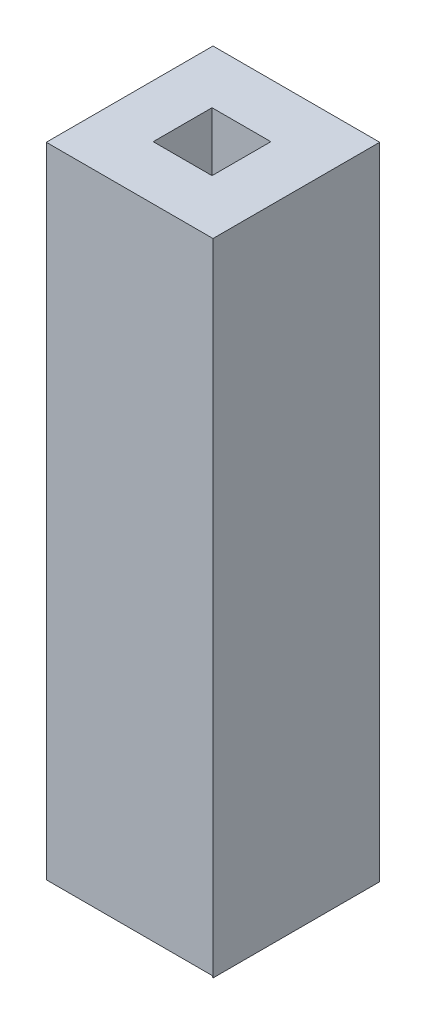
ISO-10303-21;
HEADER;
FILE_DESCRIPTION(('STEP AP214'),'2;1');
FILE_NAME('part.step','',(''),(''),'','','');
FILE_SCHEMA(('AUTOMOTIVE_DESIGN { 1 0 10303 214 1 1 1 1 }'));
ENDSEC;
DATA;
#1=APPLICATION_CONTEXT('core data for automotive mechanical design processes');
#2=APPLICATION_PROTOCOL_DEFINITION('international standard','automotive_design',2000,#1);
#3=PRODUCT_CONTEXT('',#1,'mechanical');
#4=PRODUCT('Part','Part','',(#3));
#5=PRODUCT_RELATED_PRODUCT_CATEGORY('part','',(#4));
#6=PRODUCT_DEFINITION_FORMATION('','',#4);
#7=PRODUCT_DEFINITION_CONTEXT('part definition',#1,'design');
#8=PRODUCT_DEFINITION('design','',#6,#7);
#9=PRODUCT_DEFINITION_SHAPE('','',#8);
#10=(LENGTH_UNIT() NAMED_UNIT(*) SI_UNIT(.MILLI.,.METRE.));
#11=(NAMED_UNIT(*) PLANE_ANGLE_UNIT() SI_UNIT($,.RADIAN.));
#12=(NAMED_UNIT(*) SI_UNIT($,.STERADIAN.) SOLID_ANGLE_UNIT());
#13=UNCERTAINTY_MEASURE_WITH_UNIT(LENGTH_MEASURE(1.E-05),#10,'distance_accuracy_value','');
#14=(GEOMETRIC_REPRESENTATION_CONTEXT(3) GLOBAL_UNCERTAINTY_ASSIGNED_CONTEXT((#13)) GLOBAL_UNIT_ASSIGNED_CONTEXT((#10,
#11,#12)) REPRESENTATION_CONTEXT('',''));
#15=CARTESIAN_POINT('',(0.,0.,0.));
#16=DIRECTION('',(0.,0.,1.));
#17=DIRECTION('',(1.,0.,0.));
#18=AXIS2_PLACEMENT_3D('',#15,#16,#17);
#19=CARTESIAN_POINT('',(0.,11.,0.));
#20=DIRECTION('',(1.,0.,0.));
#21=DIRECTION('',(0.,0.,-1.));
#22=AXIS2_PLACEMENT_3D('',#19,#20,#21);
#23=PLANE('',#22);
#24=DIRECTION('',(0.,0.,1.));
#25=VECTOR('',#24,1.);
#26=CARTESIAN_POINT('',(0.,0.17320508075691,-0.916665000000001));
#27=LINE('',#26,#25);
#28=CARTESIAN_POINT('',(0.,0.17320508075691,-2.816665));
#29=VERTEX_POINT('',#28);
#30=CARTESIAN_POINT('',(0.,0.17320508075691,-0.0166650000000009));
#31=VERTEX_POINT('',#30);
#32=EDGE_CURVE('E174',#29,#31,#27,.T.);
#33=ORIENTED_EDGE('',*,*,#32,.T.);
#34=DIRECTION('',(0.,-0.866025403784441,0.499999999999996));
#35=VECTOR('',#34,1.);
#36=CARTESIAN_POINT('',(0.,1.73205080756892,-0.916665000000001));
#37=LINE('',#36,#35);
#38=CARTESIAN_POINT('',(0.,0.144340454048774,0.));
#39=VERTEX_POINT('',#38);
#40=EDGE_CURVE('E176',#31,#39,#37,.T.);
#41=ORIENTED_EDGE('',*,*,#40,.T.);
#42=DIRECTION('',(0.,-1.,0.));
#43=VECTOR('',#42,1.);
#44=CARTESIAN_POINT('',(0.,11.,0.));
#45=LINE('',#44,#43);
#46=CARTESIAN_POINT('',(0.,11.,0.));
#47=VERTEX_POINT('',#46);
#48=EDGE_CURVE('E166',#47,#39,#45,.T.);
#49=ORIENTED_EDGE('',*,*,#48,.F.);
#50=DIRECTION('',(0.,0.,1.));
#51=VECTOR('',#50,1.);
#52=CARTESIAN_POINT('',(0.,11.,0.));
#53=LINE('',#52,#51);
#54=CARTESIAN_POINT('',(0.,11.,-2.83333));
#55=VERTEX_POINT('',#54);
#56=EDGE_CURVE('E146',#55,#47,#53,.T.);
#57=ORIENTED_EDGE('',*,*,#56,.F.);
#58=DIRECTION('',(0.,-1.,0.));
#59=VECTOR('',#58,1.);
#60=CARTESIAN_POINT('',(0.,11.,-2.83333));
#61=LINE('',#60,#59);
#62=CARTESIAN_POINT('',(0.,0.14434045404878,-2.83333));
#63=VERTEX_POINT('',#62);
#64=EDGE_CURVE('E159',#55,#63,#61,.T.);
#65=ORIENTED_EDGE('',*,*,#64,.T.);
#66=DIRECTION('',(0.,0.866025403784441,0.499999999999996));
#67=VECTOR('',#66,1.);
#68=CARTESIAN_POINT('',(0.,1.73205080756892,-1.916665));
#69=LINE('',#68,#67);
#70=EDGE_CURVE('E172',#63,#29,#69,.T.);
#71=ORIENTED_EDGE('',*,*,#70,.T.);
#72=EDGE_LOOP('',(#33,#41,#49,#57,#65,#71));
#73=FACE_BOUND('',#72,.T.);
#74=ADVANCED_FACE('F33',(#73),#23,.F.);
#75=CARTESIAN_POINT('',(0.,11.,0.));
#76=DIRECTION('',(0.,0.,-1.));
#77=DIRECTION('',(-1.,0.,0.));
#78=AXIS2_PLACEMENT_3D('',#75,#76,#77);
#79=PLANE('',#78);
#80=ORIENTED_EDGE('',*,*,#48,.T.);
#81=DIRECTION('',(1.,0.,0.));
#82=VECTOR('',#81,1.);
#83=CARTESIAN_POINT('',(1.9,0.144340454048773,0.));
#84=LINE('',#83,#82);
#85=CARTESIAN_POINT('',(2.816665,0.144340454048772,0.));
#86=VERTEX_POINT('',#85);
#87=EDGE_CURVE('E181',#39,#86,#84,.T.);
#88=ORIENTED_EDGE('',*,*,#87,.T.);
#89=DIRECTION('',(0.499999999999996,-0.866025403784441,0.));
#90=VECTOR('',#89,1.);
#91=CARTESIAN_POINT('',(1.9,1.73205080756892,0.));
#92=LINE('',#91,#90);
#93=CARTESIAN_POINT('',(2.83333,0.115475827340637,0.));
#94=VERTEX_POINT('',#93);
#95=EDGE_CURVE('E179',#86,#94,#92,.T.);
#96=ORIENTED_EDGE('',*,*,#95,.T.);
#97=DIRECTION('',(0.,-1.,0.));
#98=VECTOR('',#97,1.);
#99=CARTESIAN_POINT('',(2.83333,11.,0.));
#100=LINE('',#99,#98);
#101=CARTESIAN_POINT('',(2.83333,11.,0.));
#102=VERTEX_POINT('',#101);
#103=EDGE_CURVE('E164',#102,#94,#100,.T.);
#104=ORIENTED_EDGE('',*,*,#103,.F.);
#105=DIRECTION('',(1.,0.,0.));
#106=VECTOR('',#105,1.);
#107=CARTESIAN_POINT('',(0.,11.,0.));
#108=LINE('',#107,#106);
#109=EDGE_CURVE('E153',#47,#102,#108,.T.);
#110=ORIENTED_EDGE('',*,*,#109,.F.);
#111=EDGE_LOOP('',(#80,#88,#96,#104,#110));
#112=FACE_BOUND('',#111,.T.);
#113=ADVANCED_FACE('F217',(#112),#79,.F.);
#114=CARTESIAN_POINT('',(2.83333,11.,0.));
#115=DIRECTION('',(-1.,0.,0.));
#116=DIRECTION('',(0.,0.,1.));
#117=AXIS2_PLACEMENT_3D('',#114,#115,#116);
#118=PLANE('',#117);
#119=ORIENTED_EDGE('',*,*,#103,.T.);
#120=DIRECTION('',(0.,0.,-1.));
#121=VECTOR('',#120,1.);
#122=CARTESIAN_POINT('',(2.83333,0.115475827340637,-0.916665000000003));
#123=LINE('',#122,#121);
#124=CARTESIAN_POINT('',(2.83333,0.115475827340643,-2.83333));
#125=VERTEX_POINT('',#124);
#126=EDGE_CURVE('E11',#94,#125,#123,.T.);
#127=ORIENTED_EDGE('',*,*,#126,.T.);
#128=DIRECTION('',(0.,-1.,0.));
#129=VECTOR('',#128,1.);
#130=CARTESIAN_POINT('',(2.83333,11.,-2.83333));
#131=LINE('',#130,#129);
#132=CARTESIAN_POINT('',(2.83333,11.,-2.83333));
#133=VERTEX_POINT('',#132);
#134=EDGE_CURVE('E162',#133,#125,#131,.T.);
#135=ORIENTED_EDGE('',*,*,#134,.F.);
#136=DIRECTION('',(0.,0.,-1.));
#137=VECTOR('',#136,1.);
#138=CARTESIAN_POINT('',(2.83333,11.,0.));
#139=LINE('',#138,#137);
#140=EDGE_CURVE('E155',#102,#133,#139,.T.);
#141=ORIENTED_EDGE('',*,*,#140,.F.);
#142=EDGE_LOOP('',(#119,#127,#135,#141));
#143=FACE_BOUND('',#142,.T.);
#144=ADVANCED_FACE('F226',(#143),#118,.F.);
#145=CARTESIAN_POINT('',(0.,11.,-2.83333));
#146=DIRECTION('',(0.,0.,1.));
#147=DIRECTION('',(1.,0.,0.));
#148=AXIS2_PLACEMENT_3D('',#145,#146,#147);
#149=PLANE('',#148);
#150=DIRECTION('',(-0.499999999999996,0.866025403784441,0.));
#151=VECTOR('',#150,1.);
#152=CARTESIAN_POINT('',(1.9,1.73205080756892,-2.83333));
#153=LINE('',#152,#151);
#154=CARTESIAN_POINT('',(2.816665,0.144340454048773,-2.83333));
#155=VERTEX_POINT('',#154);
#156=EDGE_CURVE('E50',#125,#155,#153,.T.);
#157=ORIENTED_EDGE('',*,*,#156,.T.);
#158=DIRECTION('',(-1.,0.,0.));
#159=VECTOR('',#158,1.);
#160=CARTESIAN_POINT('',(1.9,0.144340454048773,-2.83333));
#161=LINE('',#160,#159);
#162=EDGE_CURVE('E187',#155,#63,#161,.T.);
#163=ORIENTED_EDGE('',*,*,#162,.T.);
#164=ORIENTED_EDGE('',*,*,#64,.F.);
#165=DIRECTION('',(-1.,0.,0.));
#166=VECTOR('',#165,1.);
#167=CARTESIAN_POINT('',(0.,11.,-2.83333));
#168=LINE('',#167,#166);
#169=EDGE_CURVE('E157',#133,#55,#168,.T.);
#170=ORIENTED_EDGE('',*,*,#169,.F.);
#171=ORIENTED_EDGE('',*,*,#134,.T.);
#172=EDGE_LOOP('',(#157,#163,#164,#170,#171));
#173=FACE_BOUND('',#172,.T.);
#174=ADVANCED_FACE('F223',(#173),#149,.F.);
#175=CARTESIAN_POINT('',(0.,11.,0.));
#176=DIRECTION('',(0.,-1.,0.));
#177=DIRECTION('',(0.,0.,-1.));
#178=AXIS2_PLACEMENT_3D('',#175,#176,#177);
#179=PLANE('',#178);
#180=DIRECTION('',(-1.,0.,0.));
#181=VECTOR('',#180,1.);
#182=CARTESIAN_POINT('',(1.9,11.,-0.916665000000001));
#183=LINE('',#182,#181);
#184=CARTESIAN_POINT('',(1.9,11.,-0.916665000000001));
#185=VERTEX_POINT('',#184);
#186=CARTESIAN_POINT('',(0.9,11.,-0.916665000000001));
#187=VERTEX_POINT('',#186);
#188=EDGE_CURVE('E124',#185,#187,#183,.T.);
#189=ORIENTED_EDGE('',*,*,#188,.T.);
#190=DIRECTION('',(0.,0.,-1.));
#191=VECTOR('',#190,1.);
#192=CARTESIAN_POINT('',(0.9,11.,-0.916665000000001));
#193=LINE('',#192,#191);
#194=CARTESIAN_POINT('',(0.9,11.,-1.916665));
#195=VERTEX_POINT('',#194);
#196=EDGE_CURVE('E117',#187,#195,#193,.T.);
#197=ORIENTED_EDGE('',*,*,#196,.T.);
#198=DIRECTION('',(1.,0.,0.));
#199=VECTOR('',#198,1.);
#200=CARTESIAN_POINT('',(1.9,11.,-1.916665));
#201=LINE('',#200,#199);
#202=CARTESIAN_POINT('',(1.9,11.,-1.916665));
#203=VERTEX_POINT('',#202);
#204=EDGE_CURVE('E128',#195,#203,#201,.T.);
#205=ORIENTED_EDGE('',*,*,#204,.T.);
#206=DIRECTION('',(0.,0.,1.));
#207=VECTOR('',#206,1.);
#208=CARTESIAN_POINT('',(1.9,11.,-0.916665000000001));
#209=LINE('',#208,#207);
#210=EDGE_CURVE('E133',#203,#185,#209,.T.);
#211=ORIENTED_EDGE('',*,*,#210,.T.);
#212=EDGE_LOOP('',(#189,#197,#205,#211));
#213=FACE_BOUND('',#212,.T.);
#214=ORIENTED_EDGE('',*,*,#56,.T.);
#215=ORIENTED_EDGE('',*,*,#109,.T.);
#216=ORIENTED_EDGE('',*,*,#140,.T.);
#217=ORIENTED_EDGE('',*,*,#169,.T.);
#218=EDGE_LOOP('',(#214,#215,#216,#217));
#219=FACE_BOUND('',#218,.T.);
#220=ADVANCED_FACE('F135',(#213,#219),#179,.F.);
#221=CARTESIAN_POINT('',(0.9,11.,-0.916665000000001));
#222=DIRECTION('',(-1.,0.,0.));
#223=DIRECTION('',(0.,0.,1.));
#224=AXIS2_PLACEMENT_3D('',#221,#222,#223);
#225=PLANE('',#224);
#226=DIRECTION('',(0.,-1.,0.));
#227=VECTOR('',#226,1.);
#228=CARTESIAN_POINT('',(0.9,11.,-0.916665000000001));
#229=LINE('',#228,#227);
#230=CARTESIAN_POINT('',(0.9,1.73205080756892,-0.916665000000001));
#231=VERTEX_POINT('',#230);
#232=EDGE_CURVE('E144',#187,#231,#229,.T.);
#233=ORIENTED_EDGE('',*,*,#232,.T.);
#234=DIRECTION('',(0.,0.,-1.));
#235=VECTOR('',#234,1.);
#236=CARTESIAN_POINT('',(0.9,1.73205080756892,-1.916665));
#237=LINE('',#236,#235);
#238=CARTESIAN_POINT('',(0.9,1.73205080756892,-1.916665));
#239=VERTEX_POINT('',#238);
#240=EDGE_CURVE('E120',#231,#239,#237,.T.);
#241=ORIENTED_EDGE('',*,*,#240,.T.);
#242=DIRECTION('',(0.,-1.,0.));
#243=VECTOR('',#242,1.);
#244=CARTESIAN_POINT('',(0.9,11.,-1.916665));
#245=LINE('',#244,#243);
#246=EDGE_CURVE('E112',#195,#239,#245,.T.);
#247=ORIENTED_EDGE('',*,*,#246,.F.);
#248=ORIENTED_EDGE('',*,*,#196,.F.);
#249=EDGE_LOOP('',(#233,#241,#247,#248));
#250=FACE_BOUND('',#249,.T.);
#251=ADVANCED_FACE('F115',(#250),#225,.F.);
#252=CARTESIAN_POINT('',(1.9,11.,-0.916665000000001));
#253=DIRECTION('',(0.,0.,1.));
#254=DIRECTION('',(1.,0.,0.));
#255=AXIS2_PLACEMENT_3D('',#252,#253,#254);
#256=PLANE('',#255);
#257=DIRECTION('',(0.,-1.,0.));
#258=VECTOR('',#257,1.);
#259=CARTESIAN_POINT('',(1.9,11.,-0.916665000000001));
#260=LINE('',#259,#258);
#261=CARTESIAN_POINT('',(1.9,1.73205080756892,-0.916665000000001));
#262=VERTEX_POINT('',#261);
#263=EDGE_CURVE('E147',#185,#262,#260,.T.);
#264=ORIENTED_EDGE('',*,*,#263,.T.);
#265=DIRECTION('',(-1.,0.,0.));
#266=VECTOR('',#265,1.);
#267=CARTESIAN_POINT('',(0.9,1.73205080756892,-0.916665000000001));
#268=LINE('',#267,#266);
#269=EDGE_CURVE('E169',#262,#231,#268,.T.);
#270=ORIENTED_EDGE('',*,*,#269,.T.);
#271=ORIENTED_EDGE('',*,*,#232,.F.);
#272=ORIENTED_EDGE('',*,*,#188,.F.);
#273=EDGE_LOOP('',(#264,#270,#271,#272));
#274=FACE_BOUND('',#273,.T.);
#275=ADVANCED_FACE('F208',(#274),#256,.F.);
#276=CARTESIAN_POINT('',(1.9,11.,-0.916665000000001));
#277=DIRECTION('',(1.,0.,0.));
#278=DIRECTION('',(0.,0.,-1.));
#279=AXIS2_PLACEMENT_3D('',#276,#277,#278);
#280=PLANE('',#279);
#281=DIRECTION('',(0.,-1.,0.));
#282=VECTOR('',#281,1.);
#283=CARTESIAN_POINT('',(1.9,11.,-1.916665));
#284=LINE('',#283,#282);
#285=CARTESIAN_POINT('',(1.9,1.73205080756892,-1.916665));
#286=VERTEX_POINT('',#285);
#287=EDGE_CURVE('E123',#203,#286,#284,.T.);
#288=ORIENTED_EDGE('',*,*,#287,.T.);
#289=DIRECTION('',(0.,0.,1.));
#290=VECTOR('',#289,1.);
#291=CARTESIAN_POINT('',(1.9,1.73205080756892,-0.916665000000001));
#292=LINE('',#291,#290);
#293=EDGE_CURVE('E42',#286,#262,#292,.T.);
#294=ORIENTED_EDGE('',*,*,#293,.T.);
#295=ORIENTED_EDGE('',*,*,#263,.F.);
#296=ORIENTED_EDGE('',*,*,#210,.F.);
#297=EDGE_LOOP('',(#288,#294,#295,#296));
#298=FACE_BOUND('',#297,.T.);
#299=ADVANCED_FACE('F205',(#298),#280,.F.);
#300=CARTESIAN_POINT('',(1.9,11.,-1.916665));
#301=DIRECTION('',(0.,0.,-1.));
#302=DIRECTION('',(-1.,0.,0.));
#303=AXIS2_PLACEMENT_3D('',#300,#301,#302);
#304=PLANE('',#303);
#305=ORIENTED_EDGE('',*,*,#246,.T.);
#306=DIRECTION('',(1.,0.,0.));
#307=VECTOR('',#306,1.);
#308=CARTESIAN_POINT('',(1.9,1.73205080756892,-1.916665));
#309=LINE('',#308,#307);
#310=EDGE_CURVE('E184',#239,#286,#309,.T.);
#311=ORIENTED_EDGE('',*,*,#310,.T.);
#312=ORIENTED_EDGE('',*,*,#287,.F.);
#313=ORIENTED_EDGE('',*,*,#204,.F.);
#314=EDGE_LOOP('',(#305,#311,#312,#313));
#315=FACE_BOUND('',#314,.T.);
#316=ADVANCED_FACE('F129',(#315),#304,.F.);
#317=CARTESIAN_POINT('',(1.9,1.73205080756892,-1.916665));
#318=DIRECTION('',(0.,-0.499999999999996,0.866025403784441));
#319=DIRECTION('',(-1.,0.,0.));
#320=AXIS2_PLACEMENT_3D('',#317,#318,#319);
#321=PLANE('',#320);
#322=ORIENTED_EDGE('',*,*,#70,.F.);
#323=ORIENTED_EDGE('',*,*,#162,.F.);
#324=DIRECTION('',(-0.447213595499955,0.774596669241486,0.447213595499955));
#325=VECTOR('',#324,1.);
#326=CARTESIAN_POINT('',(1.7,2.07846096908269,-1.716665));
#327=LINE('',#326,#325);
#328=EDGE_CURVE('E37',#286,#155,#327,.F.);
#329=ORIENTED_EDGE('',*,*,#328,.F.);
#330=ORIENTED_EDGE('',*,*,#310,.F.);
#331=DIRECTION('',(0.447213595499955,0.774596669241486,0.447213595499955));
#332=VECTOR('',#331,1.);
#333=CARTESIAN_POINT('',(1.1,2.07846096908269,-1.716665));
#334=LINE('',#333,#332);
#335=EDGE_CURVE('E140',#29,#239,#334,.T.);
#336=ORIENTED_EDGE('',*,*,#335,.F.);
#337=EDGE_LOOP('',(#322,#323,#329,#330,#336));
#338=FACE_BOUND('',#337,.T.);
#339=ADVANCED_FACE('F35',(#338),#321,.T.);
#340=CARTESIAN_POINT('',(1.9,1.73205080756892,-0.916665000000001));
#341=DIRECTION('',(-0.866025403784441,-0.499999999999996,0.));
#342=DIRECTION('',(0.,0.,-1.));
#343=AXIS2_PLACEMENT_3D('',#340,#341,#342);
#344=PLANE('',#343);
#345=ORIENTED_EDGE('',*,*,#126,.F.);
#346=ORIENTED_EDGE('',*,*,#95,.F.);
#347=DIRECTION('',(0.447213595499955,-0.774596669241486,0.447213595499955));
#348=VECTOR('',#347,1.);
#349=CARTESIAN_POINT('',(1.9,1.73205080756892,-0.916665000000001));
#350=LINE('',#349,#348);
#351=EDGE_CURVE('E192',#262,#86,#350,.T.);
#352=ORIENTED_EDGE('',*,*,#351,.F.);
#353=ORIENTED_EDGE('',*,*,#293,.F.);
#354=ORIENTED_EDGE('',*,*,#328,.T.);
#355=ORIENTED_EDGE('',*,*,#156,.F.);
#356=EDGE_LOOP('',(#345,#346,#352,#353,#354,#355));
#357=FACE_BOUND('',#356,.T.);
#358=ADVANCED_FACE('F225',(#357),#344,.T.);
#359=CARTESIAN_POINT('',(0.9,1.73205080756892,-0.916665000000001));
#360=DIRECTION('',(0.866025403784441,-0.499999999999996,0.));
#361=DIRECTION('',(0.,0.,1.));
#362=AXIS2_PLACEMENT_3D('',#359,#360,#361);
#363=PLANE('',#362);
#364=ORIENTED_EDGE('',*,*,#335,.T.);
#365=ORIENTED_EDGE('',*,*,#240,.F.);
#366=DIRECTION('',(0.447213595499955,0.774596669241486,-0.447213595499955));
#367=VECTOR('',#366,1.);
#368=CARTESIAN_POINT('',(0.9,1.73205080756892,-0.916665000000001));
#369=LINE('',#368,#367);
#370=EDGE_CURVE('E190',#31,#231,#369,.T.);
#371=ORIENTED_EDGE('',*,*,#370,.F.);
#372=ORIENTED_EDGE('',*,*,#32,.F.);
#373=EDGE_LOOP('',(#364,#365,#371,#372));
#374=FACE_BOUND('',#373,.T.);
#375=ADVANCED_FACE('F198',(#374),#363,.T.);
#376=CARTESIAN_POINT('',(1.9,1.73205080756892,-0.916665000000001));
#377=DIRECTION('',(0.,-0.499999999999996,-0.866025403784441));
#378=DIRECTION('',(1.,0.,0.));
#379=AXIS2_PLACEMENT_3D('',#376,#377,#378);
#380=PLANE('',#379);
#381=ORIENTED_EDGE('',*,*,#351,.T.);
#382=ORIENTED_EDGE('',*,*,#87,.F.);
#383=ORIENTED_EDGE('',*,*,#40,.F.);
#384=ORIENTED_EDGE('',*,*,#370,.T.);
#385=ORIENTED_EDGE('',*,*,#269,.F.);
#386=EDGE_LOOP('',(#381,#382,#383,#384,#385));
#387=FACE_BOUND('',#386,.T.);
#388=ADVANCED_FACE('F211',(#387),#380,.T.);
#389=CLOSED_SHELL('',(#74,#113,#144,#174,#220,#251,#275,#299,#316,#339,#358,#375,#388));
#390=MANIFOLD_SOLID_BREP('B2',#389);
#391=ADVANCED_BREP_SHAPE_REPRESENTATION('',(#18,#390),#14);
#392=SHAPE_DEFINITION_REPRESENTATION(#9,#391);
ENDSEC;
END-ISO-10303-21;
